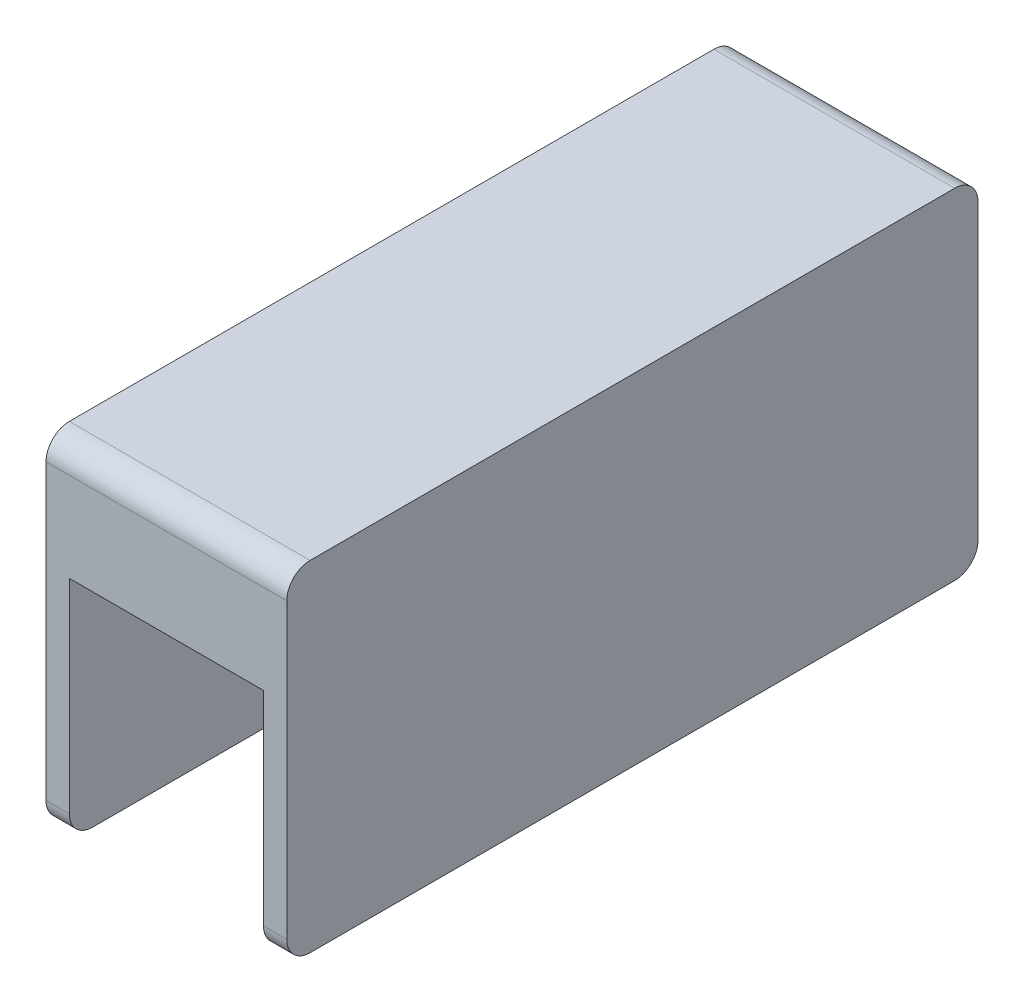
ISO-10303-21;
HEADER;
FILE_DESCRIPTION(('STEP AP214'),'2;1');
FILE_NAME('part.step','',(''),(''),'','','');
FILE_SCHEMA(('AUTOMOTIVE_DESIGN { 1 0 10303 214 1 1 1 1 }'));
ENDSEC;
DATA;
#1=APPLICATION_CONTEXT('core data for automotive mechanical design processes');
#2=APPLICATION_PROTOCOL_DEFINITION('international standard','automotive_design',2000,#1);
#3=PRODUCT_CONTEXT('',#1,'mechanical');
#4=PRODUCT('Part','Part','',(#3));
#5=PRODUCT_RELATED_PRODUCT_CATEGORY('part','',(#4));
#6=PRODUCT_DEFINITION_FORMATION('','',#4);
#7=PRODUCT_DEFINITION_CONTEXT('part definition',#1,'design');
#8=PRODUCT_DEFINITION('design','',#6,#7);
#9=PRODUCT_DEFINITION_SHAPE('','',#8);
#10=(LENGTH_UNIT() NAMED_UNIT(*) SI_UNIT(.MILLI.,.METRE.));
#11=(NAMED_UNIT(*) PLANE_ANGLE_UNIT() SI_UNIT($,.RADIAN.));
#12=(NAMED_UNIT(*) SI_UNIT($,.STERADIAN.) SOLID_ANGLE_UNIT());
#13=UNCERTAINTY_MEASURE_WITH_UNIT(LENGTH_MEASURE(1.E-05),#10,'distance_accuracy_value','');
#14=(GEOMETRIC_REPRESENTATION_CONTEXT(3) GLOBAL_UNCERTAINTY_ASSIGNED_CONTEXT((#13)) GLOBAL_UNIT_ASSIGNED_CONTEXT((#10,
#11,#12)) REPRESENTATION_CONTEXT('',''));
#15=CARTESIAN_POINT('',(0.,0.,0.));
#16=DIRECTION('',(0.,0.,1.));
#17=DIRECTION('',(1.,0.,0.));
#18=AXIS2_PLACEMENT_3D('',#15,#16,#17);
#19=CARTESIAN_POINT('',(25.,20.9769260765077,-25.4015999198652));
#20=DIRECTION('',(-1.,0.,0.));
#21=DIRECTION('',(0.,0.,1.));
#22=AXIS2_PLACEMENT_3D('',#19,#20,#21);
#23=CYLINDRICAL_SURFACE('',#22,3.);
#24=DIRECTION('',(-1.,0.,0.));
#25=VECTOR('',#24,1.);
#26=CARTESIAN_POINT('',(25.,20.9769260765077,-28.4015999198652));
#27=LINE('',#26,#25);
#28=CARTESIAN_POINT('',(28.,20.9769260765077,-28.4015999198652));
#29=VERTEX_POINT('',#28);
#30=CARTESIAN_POINT('',(-3.,20.9769260765077,-28.4015999198652));
#31=VERTEX_POINT('',#30);
#32=EDGE_CURVE('E287',#29,#31,#27,.T.);
#33=ORIENTED_EDGE('',*,*,#32,.T.);
#34=CARTESIAN_POINT('',(-3.,20.9769260765077,-25.4015999198652));
#35=DIRECTION('',(-1.,0.,0.));
#36=DIRECTION('',(0.,0.,-1.));
#37=AXIS2_PLACEMENT_3D('',#34,#35,#36);
#38=CIRCLE('',#37,3.);
#39=CARTESIAN_POINT('',(-3.,23.9769260765077,-25.4015999198652));
#40=VERTEX_POINT('',#39);
#41=EDGE_CURVE('E231',#40,#31,#38,.T.);
#42=ORIENTED_EDGE('',*,*,#41,.F.);
#43=DIRECTION('',(-1.,0.,0.));
#44=VECTOR('',#43,1.);
#45=CARTESIAN_POINT('',(25.,23.9769260765077,-25.4015999198652));
#46=LINE('',#45,#44);
#47=CARTESIAN_POINT('',(28.,23.9769260765077,-25.4015999198652));
#48=VERTEX_POINT('',#47);
#49=EDGE_CURVE('E11',#48,#40,#46,.T.);
#50=ORIENTED_EDGE('',*,*,#49,.F.);
#51=CARTESIAN_POINT('',(28.,20.9769260765077,-25.4015999198652));
#52=DIRECTION('',(1.,0.,0.));
#53=DIRECTION('',(0.,0.,1.));
#54=AXIS2_PLACEMENT_3D('',#51,#52,#53);
#55=CIRCLE('',#54,3.);
#56=EDGE_CURVE('E186',#29,#48,#55,.T.);
#57=ORIENTED_EDGE('',*,*,#56,.F.);
#58=EDGE_LOOP('',(#33,#42,#50,#57));
#59=FACE_BOUND('',#58,.T.);
#60=ADVANCED_FACE('F33',(#59),#23,.T.);
#61=CARTESIAN_POINT('',(25.,23.9769260765077,57.5984000801349));
#62=DIRECTION('',(0.,-1.,0.));
#63=DIRECTION('',(0.,0.,-1.));
#64=AXIS2_PLACEMENT_3D('',#61,#62,#63);
#65=PLANE('',#64);
#66=ORIENTED_EDGE('',*,*,#49,.T.);
#67=DIRECTION('',(0.,0.,-1.));
#68=VECTOR('',#67,1.);
#69=CARTESIAN_POINT('',(-3.,23.9769260765077,16.0984000801349));
#70=LINE('',#69,#68);
#71=CARTESIAN_POINT('',(-3.,23.9769260765077,57.5984000801349));
#72=VERTEX_POINT('',#71);
#73=EDGE_CURVE('E171',#72,#40,#70,.T.);
#74=ORIENTED_EDGE('',*,*,#73,.F.);
#75=DIRECTION('',(-1.,0.,0.));
#76=VECTOR('',#75,1.);
#77=CARTESIAN_POINT('',(25.,23.9769260765077,57.5984000801349));
#78=LINE('',#77,#76);
#79=CARTESIAN_POINT('',(28.,23.9769260765077,57.5984000801349));
#80=VERTEX_POINT('',#79);
#81=EDGE_CURVE('E41',#80,#72,#78,.T.);
#82=ORIENTED_EDGE('',*,*,#81,.F.);
#83=DIRECTION('',(0.,0.,1.));
#84=VECTOR('',#83,1.);
#85=CARTESIAN_POINT('',(28.,23.9769260765077,16.0984000801349));
#86=LINE('',#85,#84);
#87=EDGE_CURVE('E168',#48,#80,#86,.T.);
#88=ORIENTED_EDGE('',*,*,#87,.F.);
#89=EDGE_LOOP('',(#66,#74,#82,#88));
#90=FACE_BOUND('',#89,.T.);
#91=ADVANCED_FACE('F166',(#90),#65,.F.);
#92=CARTESIAN_POINT('',(25.,20.9769260765077,57.5984000801349));
#93=DIRECTION('',(-1.,0.,0.));
#94=DIRECTION('',(0.,0.,1.));
#95=AXIS2_PLACEMENT_3D('',#92,#93,#94);
#96=CYLINDRICAL_SURFACE('',#95,3.);
#97=ORIENTED_EDGE('',*,*,#81,.T.);
#98=CARTESIAN_POINT('',(-3.,20.9769260765077,57.5984000801349));
#99=DIRECTION('',(-1.,0.,0.));
#100=DIRECTION('',(0.,0.,-1.));
#101=AXIS2_PLACEMENT_3D('',#98,#99,#100);
#102=CIRCLE('',#101,3.);
#103=CARTESIAN_POINT('',(-3.,20.9769260765077,60.5984000801349));
#104=VERTEX_POINT('',#103);
#105=EDGE_CURVE('E227',#104,#72,#102,.T.);
#106=ORIENTED_EDGE('',*,*,#105,.F.);
#107=DIRECTION('',(-1.,0.,0.));
#108=VECTOR('',#107,1.);
#109=CARTESIAN_POINT('',(25.,20.9769260765077,60.5984000801349));
#110=LINE('',#109,#108);
#111=CARTESIAN_POINT('',(28.,20.9769260765077,60.5984000801349));
#112=VERTEX_POINT('',#111);
#113=EDGE_CURVE('E175',#112,#104,#110,.T.);
#114=ORIENTED_EDGE('',*,*,#113,.F.);
#115=CARTESIAN_POINT('',(28.,20.9769260765077,57.5984000801349));
#116=DIRECTION('',(1.,0.,0.));
#117=DIRECTION('',(0.,0.,1.));
#118=AXIS2_PLACEMENT_3D('',#115,#116,#117);
#119=CIRCLE('',#118,3.);
#120=EDGE_CURVE('E177',#80,#112,#119,.T.);
#121=ORIENTED_EDGE('',*,*,#120,.F.);
#122=EDGE_LOOP('',(#97,#106,#114,#121));
#123=FACE_BOUND('',#122,.T.);
#124=ADVANCED_FACE('F178',(#123),#96,.T.);
#125=CARTESIAN_POINT('',(25.,9.47692607650769,60.5984000801349));
#126=DIRECTION('',(0.,0.,-1.));
#127=DIRECTION('',(0.,1.,0.));
#128=AXIS2_PLACEMENT_3D('',#125,#126,#127);
#129=PLANE('',#128);
#130=ORIENTED_EDGE('',*,*,#113,.T.);
#131=DIRECTION('',(0.,1.,0.));
#132=VECTOR('',#131,1.);
#133=CARTESIAN_POINT('',(-3.,15.2269260765077,60.5984000801349));
#134=LINE('',#133,#132);
#135=CARTESIAN_POINT('',(-3.,-16.7730739234923,60.5984000801349));
#136=VERTEX_POINT('',#135);
#137=EDGE_CURVE('E224',#136,#104,#134,.T.);
#138=ORIENTED_EDGE('',*,*,#137,.F.);
#139=DIRECTION('',(1.,0.,0.));
#140=VECTOR('',#139,1.);
#141=CARTESIAN_POINT('',(-3.,-16.7730739234923,60.5984000801349));
#142=LINE('',#141,#140);
#143=CARTESIAN_POINT('',(0.,-16.7730739234923,60.5984000801349));
#144=VERTEX_POINT('',#143);
#145=EDGE_CURVE('E242',#136,#144,#142,.T.);
#146=ORIENTED_EDGE('',*,*,#145,.T.);
#147=DIRECTION('',(0.,1.,0.));
#148=VECTOR('',#147,1.);
#149=CARTESIAN_POINT('',(0.,15.2269260765077,60.5984000801349));
#150=LINE('',#149,#148);
#151=CARTESIAN_POINT('',(0.,9.47692607650772,60.5984000801349));
#152=VERTEX_POINT('',#151);
#153=EDGE_CURVE('E223',#144,#152,#150,.T.);
#154=ORIENTED_EDGE('',*,*,#153,.T.);
#155=DIRECTION('',(-1.,0.,0.));
#156=VECTOR('',#155,1.);
#157=CARTESIAN_POINT('',(25.,9.47692607650769,60.5984000801349));
#158=LINE('',#157,#156);
#159=CARTESIAN_POINT('',(25.,9.47692607650769,60.5984000801349));
#160=VERTEX_POINT('',#159);
#161=EDGE_CURVE('E326',#160,#152,#158,.T.);
#162=ORIENTED_EDGE('',*,*,#161,.F.);
#163=DIRECTION('',(0.,-1.,0.));
#164=VECTOR('',#163,1.);
#165=CARTESIAN_POINT('',(25.,15.2269260765077,60.5984000801349));
#166=LINE('',#165,#164);
#167=CARTESIAN_POINT('',(25.,-16.7730739234923,60.5984000801349));
#168=VERTEX_POINT('',#167);
#169=EDGE_CURVE('E204',#160,#168,#166,.T.);
#170=ORIENTED_EDGE('',*,*,#169,.T.);
#171=DIRECTION('',(-1.,0.,0.));
#172=VECTOR('',#171,1.);
#173=CARTESIAN_POINT('',(28.,-16.7730739234923,60.5984000801349));
#174=LINE('',#173,#172);
#175=CARTESIAN_POINT('',(28.,-16.7730739234923,60.5984000801349));
#176=VERTEX_POINT('',#175);
#177=EDGE_CURVE('E220',#176,#168,#174,.T.);
#178=ORIENTED_EDGE('',*,*,#177,.F.);
#179=DIRECTION('',(0.,-1.,0.));
#180=VECTOR('',#179,1.);
#181=CARTESIAN_POINT('',(28.,20.9769260765077,60.5984000801349));
#182=LINE('',#181,#180);
#183=EDGE_CURVE('E181',#112,#176,#182,.T.);
#184=ORIENTED_EDGE('',*,*,#183,.F.);
#185=EDGE_LOOP('',(#130,#138,#146,#154,#162,#170,#178,#184));
#186=FACE_BOUND('',#185,.T.);
#187=ADVANCED_FACE('F331',(#186),#129,.F.);
#188=CARTESIAN_POINT('',(25.,9.47692607650771,57.5984000801349));
#189=DIRECTION('',(-1.,0.,0.));
#190=DIRECTION('',(0.,0.,1.));
#191=AXIS2_PLACEMENT_3D('',#188,#189,#190);
#192=CYLINDRICAL_SURFACE('',#191,2.99999999999999);
#193=CARTESIAN_POINT('',(0.,9.47692607650771,57.5984000801349));
#194=DIRECTION('',(-1.,0.,0.));
#195=DIRECTION('',(0.,0.,1.));
#196=AXIS2_PLACEMENT_3D('',#193,#194,#195);
#197=CIRCLE('',#196,2.99999999999999);
#198=CARTESIAN_POINT('',(0.,12.3387436807585,56.6984000801349));
#199=VERTEX_POINT('',#198);
#200=EDGE_CURVE('E264',#152,#199,#197,.T.);
#201=ORIENTED_EDGE('',*,*,#200,.T.);
#202=DIRECTION('',(-1.,0.,0.));
#203=VECTOR('',#202,1.);
#204=CARTESIAN_POINT('',(25.,12.3387436807585,56.6984000801349));
#205=LINE('',#204,#203);
#206=CARTESIAN_POINT('',(25.,12.3387436807585,56.6984000801349));
#207=VERTEX_POINT('',#206);
#208=EDGE_CURVE('E323',#207,#199,#205,.T.);
#209=ORIENTED_EDGE('',*,*,#208,.F.);
#210=CARTESIAN_POINT('',(25.,9.47692607650771,57.5984000801349));
#211=DIRECTION('',(-1.,0.,0.));
#212=DIRECTION('',(0.,0.,1.));
#213=AXIS2_PLACEMENT_3D('',#210,#211,#212);
#214=CIRCLE('',#213,2.99999999999999);
#215=EDGE_CURVE('E265',#160,#207,#214,.T.);
#216=ORIENTED_EDGE('',*,*,#215,.F.);
#217=ORIENTED_EDGE('',*,*,#161,.T.);
#218=EDGE_LOOP('',(#201,#209,#216,#217));
#219=FACE_BOUND('',#218,.T.);
#220=ADVANCED_FACE('F345',(#219),#192,.F.);
#221=CARTESIAN_POINT('',(25.,-0.0624659376617931,60.5984000801348));
#222=DIRECTION('',(-1.,0.,0.));
#223=DIRECTION('',(0.,0.,1.));
#224=AXIS2_PLACEMENT_3D('',#221,#222,#223);
#225=CYLINDRICAL_SURFACE('',#224,13.);
#226=CARTESIAN_POINT('',(0.,-0.0624659376617931,60.5984000801348));
#227=DIRECTION('',(-1.,0.,0.));
#228=DIRECTION('',(0.,0.,-1.));
#229=AXIS2_PLACEMENT_3D('',#226,#227,#228);
#230=CIRCLE('',#229,13.);
#231=CARTESIAN_POINT('',(0.,5.58970797538169,48.8914393277999));
#232=VERTEX_POINT('',#231);
#233=EDGE_CURVE('E290',#199,#232,#230,.T.);
#234=ORIENTED_EDGE('',*,*,#233,.T.);
#235=DIRECTION('',(-1.,0.,0.));
#236=VECTOR('',#235,1.);
#237=CARTESIAN_POINT('',(25.,5.58970797538169,48.8914393277999));
#238=LINE('',#237,#236);
#239=CARTESIAN_POINT('',(25.,5.58970797538169,48.8914393277999));
#240=VERTEX_POINT('',#239);
#241=EDGE_CURVE('E320',#240,#232,#238,.T.);
#242=ORIENTED_EDGE('',*,*,#241,.F.);
#243=CARTESIAN_POINT('',(25.,-0.0624659376617931,60.5984000801348));
#244=DIRECTION('',(-1.,0.,0.));
#245=DIRECTION('',(0.,0.,-1.));
#246=AXIS2_PLACEMENT_3D('',#243,#244,#245);
#247=CIRCLE('',#246,13.);
#248=EDGE_CURVE('E268',#207,#240,#247,.T.);
#249=ORIENTED_EDGE('',*,*,#248,.F.);
#250=ORIENTED_EDGE('',*,*,#208,.T.);
#251=EDGE_LOOP('',(#234,#242,#249,#250));
#252=FACE_BOUND('',#251,.T.);
#253=ADVANCED_FACE('F395',(#252),#225,.F.);
#254=CARTESIAN_POINT('',(25.,9.93753406233823,39.8860849029268));
#255=DIRECTION('',(-1.,0.,0.));
#256=DIRECTION('',(0.,0.,1.));
#257=AXIS2_PLACEMENT_3D('',#254,#255,#256);
#258=CYLINDRICAL_SURFACE('',#257,10.);
#259=CARTESIAN_POINT('',(0.,9.93753406233823,39.8860849029268));
#260=DIRECTION('',(1.,0.,0.));
#261=DIRECTION('',(0.,0.,-1.));
#262=AXIS2_PLACEMENT_3D('',#259,#260,#261);
#263=CIRCLE('',#262,10.);
#264=CARTESIAN_POINT('',(0.,-0.0624659376617792,39.8860849029268));
#265=VERTEX_POINT('',#264);
#266=EDGE_CURVE('E293',#232,#265,#263,.T.);
#267=ORIENTED_EDGE('',*,*,#266,.T.);
#268=DIRECTION('',(-1.,0.,0.));
#269=VECTOR('',#268,1.);
#270=CARTESIAN_POINT('',(25.,-0.0624659376617792,39.8860849029268));
#271=LINE('',#270,#269);
#272=CARTESIAN_POINT('',(25.,-0.0624659376617792,39.8860849029268));
#273=VERTEX_POINT('',#272);
#274=EDGE_CURVE('E317',#273,#265,#271,.T.);
#275=ORIENTED_EDGE('',*,*,#274,.F.);
#276=CARTESIAN_POINT('',(25.,9.93753406233823,39.8860849029268));
#277=DIRECTION('',(1.,0.,0.));
#278=DIRECTION('',(0.,0.,-1.));
#279=AXIS2_PLACEMENT_3D('',#276,#277,#278);
#280=CIRCLE('',#279,10.);
#281=EDGE_CURVE('E272',#240,#273,#280,.T.);
#282=ORIENTED_EDGE('',*,*,#281,.F.);
#283=ORIENTED_EDGE('',*,*,#241,.T.);
#284=EDGE_LOOP('',(#267,#275,#282,#283));
#285=FACE_BOUND('',#284,.T.);
#286=ADVANCED_FACE('F392',(#285),#258,.T.);
#287=CARTESIAN_POINT('',(25.,-0.0624659376617792,-7.68928474265718));
#288=DIRECTION('',(0.,1.,0.));
#289=DIRECTION('',(0.,0.,1.));
#290=AXIS2_PLACEMENT_3D('',#287,#288,#289);
#291=PLANE('',#290);
#292=DIRECTION('',(0.,0.,-1.));
#293=VECTOR('',#292,1.);
#294=CARTESIAN_POINT('',(0.,-0.0624659376617792,-7.68928474265718));
#295=LINE('',#294,#293);
#296=CARTESIAN_POINT('',(0.,-0.0624659376617775,-7.68928474265718));
#297=VERTEX_POINT('',#296);
#298=EDGE_CURVE('E296',#265,#297,#295,.T.);
#299=ORIENTED_EDGE('',*,*,#298,.T.);
#300=DIRECTION('',(-1.,0.,0.));
#301=VECTOR('',#300,1.);
#302=CARTESIAN_POINT('',(25.,-0.0624659376617775,-7.68928474265718));
#303=LINE('',#302,#301);
#304=CARTESIAN_POINT('',(25.,-0.0624659376617775,-7.68928474265718));
#305=VERTEX_POINT('',#304);
#306=EDGE_CURVE('E314',#305,#297,#303,.T.);
#307=ORIENTED_EDGE('',*,*,#306,.F.);
#308=DIRECTION('',(0.,0.,-1.));
#309=VECTOR('',#308,1.);
#310=CARTESIAN_POINT('',(25.,-0.0624659376617792,39.8860849029268));
#311=LINE('',#310,#309);
#312=EDGE_CURVE('E275',#273,#305,#311,.T.);
#313=ORIENTED_EDGE('',*,*,#312,.F.);
#314=ORIENTED_EDGE('',*,*,#274,.T.);
#315=EDGE_LOOP('',(#299,#307,#313,#314));
#316=FACE_BOUND('',#315,.T.);
#317=ADVANCED_FACE('F388',(#316),#291,.F.);
#318=CARTESIAN_POINT('',(25.,9.93753406233823,-7.68928474265718));
#319=DIRECTION('',(-1.,0.,0.));
#320=DIRECTION('',(0.,0.,1.));
#321=AXIS2_PLACEMENT_3D('',#318,#319,#320);
#322=CYLINDRICAL_SURFACE('',#321,10.);
#323=CARTESIAN_POINT('',(0.,9.93753406233823,-7.68928474265718));
#324=DIRECTION('',(1.,0.,0.));
#325=DIRECTION('',(0.,0.,1.));
#326=AXIS2_PLACEMENT_3D('',#323,#324,#325);
#327=CIRCLE('',#326,10.);
#328=CARTESIAN_POINT('',(0.,5.58970797538169,-16.6946391675302));
#329=VERTEX_POINT('',#328);
#330=EDGE_CURVE('E299',#297,#329,#327,.T.);
#331=ORIENTED_EDGE('',*,*,#330,.T.);
#332=DIRECTION('',(-1.,0.,0.));
#333=VECTOR('',#332,1.);
#334=CARTESIAN_POINT('',(25.,5.58970797538169,-16.6946391675302));
#335=LINE('',#334,#333);
#336=CARTESIAN_POINT('',(25.,5.58970797538169,-16.6946391675302));
#337=VERTEX_POINT('',#336);
#338=EDGE_CURVE('E311',#337,#329,#335,.T.);
#339=ORIENTED_EDGE('',*,*,#338,.F.);
#340=CARTESIAN_POINT('',(25.,9.93753406233823,-7.68928474265718));
#341=DIRECTION('',(1.,0.,0.));
#342=DIRECTION('',(0.,0.,1.));
#343=AXIS2_PLACEMENT_3D('',#340,#341,#342);
#344=CIRCLE('',#343,10.);
#345=EDGE_CURVE('E278',#305,#337,#344,.T.);
#346=ORIENTED_EDGE('',*,*,#345,.F.);
#347=ORIENTED_EDGE('',*,*,#306,.T.);
#348=EDGE_LOOP('',(#331,#339,#346,#347));
#349=FACE_BOUND('',#348,.T.);
#350=ADVANCED_FACE('F386',(#349),#322,.T.);
#351=CARTESIAN_POINT('',(25.,-0.0624659376617931,-28.4015999198652));
#352=DIRECTION('',(-1.,0.,0.));
#353=DIRECTION('',(0.,0.,1.));
#354=AXIS2_PLACEMENT_3D('',#351,#352,#353);
#355=CYLINDRICAL_SURFACE('',#354,13.);
#356=CARTESIAN_POINT('',(0.,-0.0624659376617931,-28.4015999198652));
#357=DIRECTION('',(-1.,0.,0.));
#358=DIRECTION('',(0.,0.,1.));
#359=AXIS2_PLACEMENT_3D('',#356,#357,#358);
#360=CIRCLE('',#359,13.);
#361=CARTESIAN_POINT('',(0.,12.3387436807586,-24.5015999198653));
#362=VERTEX_POINT('',#361);
#363=EDGE_CURVE('E302',#329,#362,#360,.T.);
#364=ORIENTED_EDGE('',*,*,#363,.T.);
#365=DIRECTION('',(-1.,0.,0.));
#366=VECTOR('',#365,1.);
#367=CARTESIAN_POINT('',(25.,12.3387436807586,-24.5015999198653));
#368=LINE('',#367,#366);
#369=CARTESIAN_POINT('',(25.,12.3387436807586,-24.5015999198653));
#370=VERTEX_POINT('',#369);
#371=EDGE_CURVE('E48',#370,#362,#368,.T.);
#372=ORIENTED_EDGE('',*,*,#371,.F.);
#373=CARTESIAN_POINT('',(25.,-0.0624659376617931,-28.4015999198652));
#374=DIRECTION('',(-1.,0.,0.));
#375=DIRECTION('',(0.,0.,1.));
#376=AXIS2_PLACEMENT_3D('',#373,#374,#375);
#377=CIRCLE('',#376,13.);
#378=EDGE_CURVE('E281',#337,#370,#377,.T.);
#379=ORIENTED_EDGE('',*,*,#378,.F.);
#380=ORIENTED_EDGE('',*,*,#338,.T.);
#381=EDGE_LOOP('',(#364,#372,#379,#380));
#382=FACE_BOUND('',#381,.T.);
#383=ADVANCED_FACE('F384',(#382),#355,.F.);
#384=CARTESIAN_POINT('',(25.,9.47692607650771,-25.4015999198653));
#385=DIRECTION('',(-1.,0.,0.));
#386=DIRECTION('',(0.,0.,1.));
#387=AXIS2_PLACEMENT_3D('',#384,#385,#386);
#388=CYLINDRICAL_SURFACE('',#387,2.99999999999999);
#389=CARTESIAN_POINT('',(0.,9.47692607650771,-25.4015999198653));
#390=DIRECTION('',(-1.,0.,0.));
#391=DIRECTION('',(0.,0.,-1.));
#392=AXIS2_PLACEMENT_3D('',#389,#390,#391);
#393=CIRCLE('',#392,2.99999999999999);
#394=CARTESIAN_POINT('',(0.,9.47692607650772,-28.4015999198652));
#395=VERTEX_POINT('',#394);
#396=EDGE_CURVE('E269',#362,#395,#393,.T.);
#397=ORIENTED_EDGE('',*,*,#396,.T.);
#398=DIRECTION('',(-1.,0.,0.));
#399=VECTOR('',#398,1.);
#400=CARTESIAN_POINT('',(25.,9.47692607650769,-28.4015999198653));
#401=LINE('',#400,#399);
#402=CARTESIAN_POINT('',(25.,9.47692607650771,-28.4015999198652));
#403=VERTEX_POINT('',#402);
#404=EDGE_CURVE('E307',#403,#395,#401,.T.);
#405=ORIENTED_EDGE('',*,*,#404,.F.);
#406=CARTESIAN_POINT('',(25.,9.47692607650771,-25.4015999198653));
#407=DIRECTION('',(-1.,0.,0.));
#408=DIRECTION('',(0.,0.,-1.));
#409=AXIS2_PLACEMENT_3D('',#406,#407,#408);
#410=CIRCLE('',#409,2.99999999999999);
#411=EDGE_CURVE('E284',#370,#403,#410,.T.);
#412=ORIENTED_EDGE('',*,*,#411,.F.);
#413=ORIENTED_EDGE('',*,*,#371,.T.);
#414=EDGE_LOOP('',(#397,#405,#412,#413));
#415=FACE_BOUND('',#414,.T.);
#416=ADVANCED_FACE('F382',(#415),#388,.F.);
#417=CARTESIAN_POINT('',(25.,9.47692607650769,-28.4015999198653));
#418=DIRECTION('',(0.,0.,1.));
#419=DIRECTION('',(0.,-1.,0.));
#420=AXIS2_PLACEMENT_3D('',#417,#418,#419);
#421=PLANE('',#420);
#422=ORIENTED_EDGE('',*,*,#404,.T.);
#423=DIRECTION('',(0.,-1.,0.));
#424=VECTOR('',#423,1.);
#425=CARTESIAN_POINT('',(0.,15.2269260765077,-28.4015999198652));
#426=LINE('',#425,#424);
#427=CARTESIAN_POINT('',(0.,-16.7730739234923,-28.4015999198653));
#428=VERTEX_POINT('',#427);
#429=EDGE_CURVE('E245',#395,#428,#426,.T.);
#430=ORIENTED_EDGE('',*,*,#429,.T.);
#431=DIRECTION('',(1.,0.,0.));
#432=VECTOR('',#431,1.);
#433=CARTESIAN_POINT('',(-3.,-16.7730739234923,-28.4015999198653));
#434=LINE('',#433,#432);
#435=CARTESIAN_POINT('',(-3.,-16.7730739234923,-28.4015999198653));
#436=VERTEX_POINT('',#435);
#437=EDGE_CURVE('E261',#436,#428,#434,.T.);
#438=ORIENTED_EDGE('',*,*,#437,.F.);
#439=DIRECTION('',(0.,-1.,0.));
#440=VECTOR('',#439,1.);
#441=CARTESIAN_POINT('',(-3.,15.2269260765077,-28.4015999198652));
#442=LINE('',#441,#440);
#443=EDGE_CURVE('E234',#31,#436,#442,.T.);
#444=ORIENTED_EDGE('',*,*,#443,.F.);
#445=ORIENTED_EDGE('',*,*,#32,.F.);
#446=DIRECTION('',(0.,1.,0.));
#447=VECTOR('',#446,1.);
#448=CARTESIAN_POINT('',(28.,15.2269260765077,-28.4015999198652));
#449=LINE('',#448,#447);
#450=CARTESIAN_POINT('',(28.,-16.7730739234923,-28.4015999198652));
#451=VERTEX_POINT('',#450);
#452=EDGE_CURVE('E200',#451,#29,#449,.T.);
#453=ORIENTED_EDGE('',*,*,#452,.F.);
#454=DIRECTION('',(-1.,0.,0.));
#455=VECTOR('',#454,1.);
#456=CARTESIAN_POINT('',(28.,-16.7730739234923,-28.4015999198652));
#457=LINE('',#456,#455);
#458=CARTESIAN_POINT('',(25.,-16.7730739234923,-28.4015999198652));
#459=VERTEX_POINT('',#458);
#460=EDGE_CURVE('E203',#451,#459,#457,.T.);
#461=ORIENTED_EDGE('',*,*,#460,.T.);
#462=DIRECTION('',(0.,1.,0.));
#463=VECTOR('',#462,1.);
#464=CARTESIAN_POINT('',(25.,15.2269260765077,-28.4015999198652));
#465=LINE('',#464,#463);
#466=EDGE_CURVE('E187',#459,#403,#465,.T.);
#467=ORIENTED_EDGE('',*,*,#466,.T.);
#468=EDGE_LOOP('',(#422,#430,#438,#444,#445,#453,#461,#467));
#469=FACE_BOUND('',#468,.T.);
#470=ADVANCED_FACE('F367',(#469),#421,.F.);
#471=CARTESIAN_POINT('',(0.,-16.7730739234923,57.5984000801349));
#472=DIRECTION('',(1.,0.,0.));
#473=DIRECTION('',(0.,0.,-1.));
#474=AXIS2_PLACEMENT_3D('',#471,#472,#473);
#475=PLANE('',#474);
#476=ORIENTED_EDGE('',*,*,#396,.F.);
#477=ORIENTED_EDGE('',*,*,#363,.F.);
#478=ORIENTED_EDGE('',*,*,#330,.F.);
#479=ORIENTED_EDGE('',*,*,#298,.F.);
#480=ORIENTED_EDGE('',*,*,#266,.F.);
#481=ORIENTED_EDGE('',*,*,#233,.F.);
#482=ORIENTED_EDGE('',*,*,#200,.F.);
#483=ORIENTED_EDGE('',*,*,#153,.F.);
#484=CARTESIAN_POINT('',(0.,-16.7730739234923,57.5984000801349));
#485=DIRECTION('',(-1.,0.,0.));
#486=DIRECTION('',(0.,0.,-1.));
#487=AXIS2_PLACEMENT_3D('',#484,#485,#486);
#488=CIRCLE('',#487,3.);
#489=CARTESIAN_POINT('',(0.,-19.7730739234923,57.5984000801349));
#490=VERTEX_POINT('',#489);
#491=EDGE_CURVE('E228',#490,#144,#488,.T.);
#492=ORIENTED_EDGE('',*,*,#491,.F.);
#493=DIRECTION('',(0.,0.,1.));
#494=VECTOR('',#493,1.);
#495=CARTESIAN_POINT('',(0.,-19.7730739234923,57.5984000801349));
#496=LINE('',#495,#494);
#497=CARTESIAN_POINT('',(0.,-19.7730739234923,-25.4015999198652));
#498=VERTEX_POINT('',#497);
#499=EDGE_CURVE('E249',#498,#490,#496,.T.);
#500=ORIENTED_EDGE('',*,*,#499,.F.);
#501=CARTESIAN_POINT('',(0.,-16.7730739234923,-25.4015999198653));
#502=DIRECTION('',(-1.,0.,0.));
#503=DIRECTION('',(0.,0.,1.));
#504=AXIS2_PLACEMENT_3D('',#501,#502,#503);
#505=CIRCLE('',#504,3.);
#506=EDGE_CURVE('E247',#428,#498,#505,.T.);
#507=ORIENTED_EDGE('',*,*,#506,.F.);
#508=ORIENTED_EDGE('',*,*,#429,.F.);
#509=EDGE_LOOP('',(#476,#477,#478,#479,#480,#481,#482,#483,#492,#500,#507,#508));
#510=FACE_BOUND('',#509,.T.);
#511=ADVANCED_FACE('F380',(#510),#475,.T.);
#512=CARTESIAN_POINT('',(-3.,-16.7730739234923,-25.4015999198653));
#513=DIRECTION('',(1.,0.,0.));
#514=DIRECTION('',(0.,0.,-1.));
#515=AXIS2_PLACEMENT_3D('',#512,#513,#514);
#516=CYLINDRICAL_SURFACE('',#515,3.);
#517=ORIENTED_EDGE('',*,*,#506,.T.);
#518=DIRECTION('',(1.,0.,0.));
#519=VECTOR('',#518,1.);
#520=CARTESIAN_POINT('',(-3.,-19.7730739234923,-25.4015999198652));
#521=LINE('',#520,#519);
#522=CARTESIAN_POINT('',(-3.,-19.7730739234923,-25.4015999198652));
#523=VERTEX_POINT('',#522);
#524=EDGE_CURVE('E258',#523,#498,#521,.T.);
#525=ORIENTED_EDGE('',*,*,#524,.F.);
#526=CARTESIAN_POINT('',(-3.,-16.7730739234923,-25.4015999198653));
#527=DIRECTION('',(-1.,0.,0.));
#528=DIRECTION('',(0.,0.,1.));
#529=AXIS2_PLACEMENT_3D('',#526,#527,#528);
#530=CIRCLE('',#529,3.);
#531=EDGE_CURVE('E236',#436,#523,#530,.T.);
#532=ORIENTED_EDGE('',*,*,#531,.F.);
#533=ORIENTED_EDGE('',*,*,#437,.T.);
#534=EDGE_LOOP('',(#517,#525,#532,#533));
#535=FACE_BOUND('',#534,.T.);
#536=ADVANCED_FACE('F376',(#535),#516,.T.);
#537=CARTESIAN_POINT('',(-3.,-19.7730739234923,57.5984000801349));
#538=DIRECTION('',(0.,1.,0.));
#539=DIRECTION('',(0.,0.,1.));
#540=AXIS2_PLACEMENT_3D('',#537,#538,#539);
#541=PLANE('',#540);
#542=ORIENTED_EDGE('',*,*,#499,.T.);
#543=DIRECTION('',(1.,0.,0.));
#544=VECTOR('',#543,1.);
#545=CARTESIAN_POINT('',(-3.,-19.7730739234923,57.5984000801349));
#546=LINE('',#545,#544);
#547=CARTESIAN_POINT('',(-3.,-19.7730739234923,57.5984000801349));
#548=VERTEX_POINT('',#547);
#549=EDGE_CURVE('E255',#548,#490,#546,.T.);
#550=ORIENTED_EDGE('',*,*,#549,.F.);
#551=DIRECTION('',(0.,0.,1.));
#552=VECTOR('',#551,1.);
#553=CARTESIAN_POINT('',(-3.,-19.7730739234923,57.5984000801349));
#554=LINE('',#553,#552);
#555=EDGE_CURVE('E238',#523,#548,#554,.T.);
#556=ORIENTED_EDGE('',*,*,#555,.F.);
#557=ORIENTED_EDGE('',*,*,#524,.T.);
#558=EDGE_LOOP('',(#542,#550,#556,#557));
#559=FACE_BOUND('',#558,.T.);
#560=ADVANCED_FACE('F379',(#559),#541,.F.);
#561=CARTESIAN_POINT('',(-3.,-16.7730739234923,57.5984000801349));
#562=DIRECTION('',(1.,0.,0.));
#563=DIRECTION('',(0.,0.,-1.));
#564=AXIS2_PLACEMENT_3D('',#561,#562,#563);
#565=CYLINDRICAL_SURFACE('',#564,3.);
#566=ORIENTED_EDGE('',*,*,#491,.T.);
#567=ORIENTED_EDGE('',*,*,#145,.F.);
#568=CARTESIAN_POINT('',(-3.,-16.7730739234923,57.5984000801349));
#569=DIRECTION('',(-1.,0.,0.));
#570=DIRECTION('',(0.,0.,-1.));
#571=AXIS2_PLACEMENT_3D('',#568,#569,#570);
#572=CIRCLE('',#571,3.);
#573=EDGE_CURVE('E240',#548,#136,#572,.T.);
#574=ORIENTED_EDGE('',*,*,#573,.F.);
#575=ORIENTED_EDGE('',*,*,#549,.T.);
#576=EDGE_LOOP('',(#566,#567,#574,#575));
#577=FACE_BOUND('',#576,.T.);
#578=ADVANCED_FACE('F340',(#577),#565,.T.);
#579=CARTESIAN_POINT('',(-3.,-16.7730739234923,57.5984000801349));
#580=DIRECTION('',(1.,0.,0.));
#581=DIRECTION('',(0.,0.,-1.));
#582=AXIS2_PLACEMENT_3D('',#579,#580,#581);
#583=PLANE('',#582);
#584=ORIENTED_EDGE('',*,*,#137,.T.);
#585=ORIENTED_EDGE('',*,*,#105,.T.);
#586=ORIENTED_EDGE('',*,*,#73,.T.);
#587=ORIENTED_EDGE('',*,*,#41,.T.);
#588=ORIENTED_EDGE('',*,*,#443,.T.);
#589=ORIENTED_EDGE('',*,*,#531,.T.);
#590=ORIENTED_EDGE('',*,*,#555,.T.);
#591=ORIENTED_EDGE('',*,*,#573,.T.);
#592=EDGE_LOOP('',(#584,#585,#586,#587,#588,#589,#590,#591));
#593=FACE_BOUND('',#592,.T.);
#594=ADVANCED_FACE('F334',(#593),#583,.F.);
#595=CARTESIAN_POINT('',(25.,20.9769260765077,57.5984000801349));
#596=DIRECTION('',(-1.,0.,0.));
#597=DIRECTION('',(0.,0.,1.));
#598=AXIS2_PLACEMENT_3D('',#595,#596,#597);
#599=PLANE('',#598);
#600=ORIENTED_EDGE('',*,*,#169,.F.);
#601=ORIENTED_EDGE('',*,*,#215,.T.);
#602=ORIENTED_EDGE('',*,*,#248,.T.);
#603=ORIENTED_EDGE('',*,*,#281,.T.);
#604=ORIENTED_EDGE('',*,*,#312,.T.);
#605=ORIENTED_EDGE('',*,*,#345,.T.);
#606=ORIENTED_EDGE('',*,*,#378,.T.);
#607=ORIENTED_EDGE('',*,*,#411,.T.);
#608=ORIENTED_EDGE('',*,*,#466,.F.);
#609=CARTESIAN_POINT('',(25.,-16.7730739234923,-25.4015999198652));
#610=DIRECTION('',(1.,0.,0.));
#611=DIRECTION('',(0.,0.,1.));
#612=AXIS2_PLACEMENT_3D('',#609,#610,#611);
#613=CIRCLE('',#612,3.);
#614=CARTESIAN_POINT('',(25.,-19.7730739234923,-25.4015999198652));
#615=VERTEX_POINT('',#614);
#616=EDGE_CURVE('E190',#615,#459,#613,.T.);
#617=ORIENTED_EDGE('',*,*,#616,.F.);
#618=DIRECTION('',(0.,0.,-1.));
#619=VECTOR('',#618,1.);
#620=CARTESIAN_POINT('',(25.,-19.7730739234923,-25.4015999198652));
#621=LINE('',#620,#619);
#622=CARTESIAN_POINT('',(25.,-19.7730739234923,57.5984000801349));
#623=VERTEX_POINT('',#622);
#624=EDGE_CURVE('E208',#623,#615,#621,.T.);
#625=ORIENTED_EDGE('',*,*,#624,.F.);
#626=CARTESIAN_POINT('',(25.,-16.7730739234923,57.5984000801349));
#627=DIRECTION('',(1.,0.,0.));
#628=DIRECTION('',(0.,0.,-1.));
#629=AXIS2_PLACEMENT_3D('',#626,#627,#628);
#630=CIRCLE('',#629,3.);
#631=EDGE_CURVE('E206',#168,#623,#630,.T.);
#632=ORIENTED_EDGE('',*,*,#631,.F.);
#633=EDGE_LOOP('',(#600,#601,#602,#603,#604,#605,#606,#607,#608,#617,#625,#632));
#634=FACE_BOUND('',#633,.T.);
#635=ADVANCED_FACE('F350',(#634),#599,.T.);
#636=CARTESIAN_POINT('',(28.,-16.7730739234923,57.5984000801349));
#637=DIRECTION('',(-1.,0.,0.));
#638=DIRECTION('',(0.,0.,1.));
#639=AXIS2_PLACEMENT_3D('',#636,#637,#638);
#640=CYLINDRICAL_SURFACE('',#639,3.);
#641=ORIENTED_EDGE('',*,*,#631,.T.);
#642=DIRECTION('',(-1.,0.,0.));
#643=VECTOR('',#642,1.);
#644=CARTESIAN_POINT('',(28.,-19.7730739234923,57.5984000801349));
#645=LINE('',#644,#643);
#646=CARTESIAN_POINT('',(28.,-19.7730739234923,57.5984000801349));
#647=VERTEX_POINT('',#646);
#648=EDGE_CURVE('E217',#647,#623,#645,.T.);
#649=ORIENTED_EDGE('',*,*,#648,.F.);
#650=CARTESIAN_POINT('',(28.,-16.7730739234923,57.5984000801349));
#651=DIRECTION('',(1.,0.,0.));
#652=DIRECTION('',(0.,0.,-1.));
#653=AXIS2_PLACEMENT_3D('',#650,#651,#652);
#654=CIRCLE('',#653,3.);
#655=EDGE_CURVE('E194',#176,#647,#654,.T.);
#656=ORIENTED_EDGE('',*,*,#655,.F.);
#657=ORIENTED_EDGE('',*,*,#177,.T.);
#658=EDGE_LOOP('',(#641,#649,#656,#657));
#659=FACE_BOUND('',#658,.T.);
#660=ADVANCED_FACE('F354',(#659),#640,.T.);
#661=CARTESIAN_POINT('',(28.,-19.7730739234923,-25.4015999198652));
#662=DIRECTION('',(0.,1.,0.));
#663=DIRECTION('',(0.,0.,1.));
#664=AXIS2_PLACEMENT_3D('',#661,#662,#663);
#665=PLANE('',#664);
#666=ORIENTED_EDGE('',*,*,#624,.T.);
#667=DIRECTION('',(-1.,0.,0.));
#668=VECTOR('',#667,1.);
#669=CARTESIAN_POINT('',(28.,-19.7730739234923,-25.4015999198652));
#670=LINE('',#669,#668);
#671=CARTESIAN_POINT('',(28.,-19.7730739234923,-25.4015999198652));
#672=VERTEX_POINT('',#671);
#673=EDGE_CURVE('E214',#672,#615,#670,.T.);
#674=ORIENTED_EDGE('',*,*,#673,.F.);
#675=DIRECTION('',(0.,0.,-1.));
#676=VECTOR('',#675,1.);
#677=CARTESIAN_POINT('',(28.,-19.7730739234923,-25.4015999198652));
#678=LINE('',#677,#676);
#679=EDGE_CURVE('E196',#647,#672,#678,.T.);
#680=ORIENTED_EDGE('',*,*,#679,.F.);
#681=ORIENTED_EDGE('',*,*,#648,.T.);
#682=EDGE_LOOP('',(#666,#674,#680,#681));
#683=FACE_BOUND('',#682,.T.);
#684=ADVANCED_FACE('F361',(#683),#665,.F.);
#685=CARTESIAN_POINT('',(28.,-16.7730739234923,-25.4015999198652));
#686=DIRECTION('',(-1.,0.,0.));
#687=DIRECTION('',(0.,0.,1.));
#688=AXIS2_PLACEMENT_3D('',#685,#686,#687);
#689=CYLINDRICAL_SURFACE('',#688,3.);
#690=ORIENTED_EDGE('',*,*,#616,.T.);
#691=ORIENTED_EDGE('',*,*,#460,.F.);
#692=CARTESIAN_POINT('',(28.,-16.7730739234923,-25.4015999198652));
#693=DIRECTION('',(1.,0.,0.));
#694=DIRECTION('',(0.,0.,1.));
#695=AXIS2_PLACEMENT_3D('',#692,#693,#694);
#696=CIRCLE('',#695,3.);
#697=EDGE_CURVE('E198',#672,#451,#696,.T.);
#698=ORIENTED_EDGE('',*,*,#697,.F.);
#699=ORIENTED_EDGE('',*,*,#673,.T.);
#700=EDGE_LOOP('',(#690,#691,#698,#699));
#701=FACE_BOUND('',#700,.T.);
#702=ADVANCED_FACE('F364',(#701),#689,.T.);
#703=CARTESIAN_POINT('',(28.,20.9769260765077,57.5984000801349));
#704=DIRECTION('',(-1.,0.,0.));
#705=DIRECTION('',(0.,0.,1.));
#706=AXIS2_PLACEMENT_3D('',#703,#704,#705);
#707=PLANE('',#706);
#708=ORIENTED_EDGE('',*,*,#87,.T.);
#709=ORIENTED_EDGE('',*,*,#120,.T.);
#710=ORIENTED_EDGE('',*,*,#183,.T.);
#711=ORIENTED_EDGE('',*,*,#655,.T.);
#712=ORIENTED_EDGE('',*,*,#679,.T.);
#713=ORIENTED_EDGE('',*,*,#697,.T.);
#714=ORIENTED_EDGE('',*,*,#452,.T.);
#715=ORIENTED_EDGE('',*,*,#56,.T.);
#716=EDGE_LOOP('',(#708,#709,#710,#711,#712,#713,#714,#715));
#717=FACE_BOUND('',#716,.T.);
#718=ADVANCED_FACE('F183',(#717),#707,.F.);
#719=CLOSED_SHELL('',(#60,#91,#124,#187,#220,#253,#286,#317,#350,#383,#416,#470,#511,#536,#560,
#578,#594,#635,#660,#684,#702,#718));
#720=MANIFOLD_SOLID_BREP('B2',#719);
#721=ADVANCED_BREP_SHAPE_REPRESENTATION('',(#18,#720),#14);
#722=SHAPE_DEFINITION_REPRESENTATION(#9,#721);
ENDSEC;
END-ISO-10303-21;
